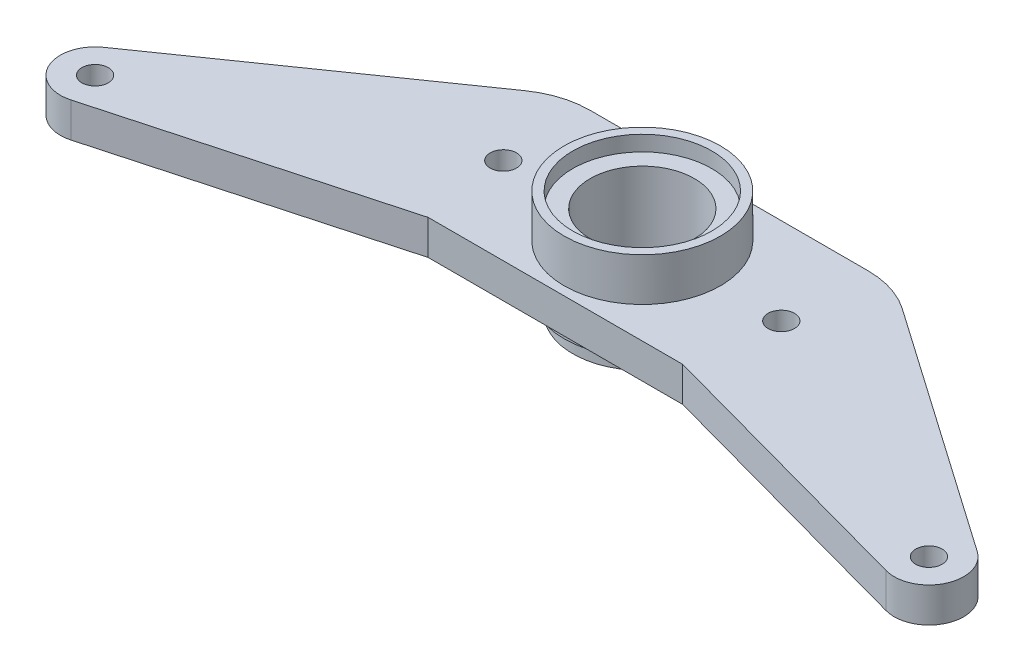
ISO-10303-21;
HEADER;
FILE_DESCRIPTION(('STEP AP214'),'2;1');
FILE_NAME('part.step','',(''),(''),'','','');
FILE_SCHEMA(('AUTOMOTIVE_DESIGN { 1 0 10303 214 1 1 1 1 }'));
ENDSEC;
DATA;
#1=APPLICATION_CONTEXT('core data for automotive mechanical design processes');
#2=APPLICATION_PROTOCOL_DEFINITION('international standard','automotive_design',2000,#1);
#3=PRODUCT_CONTEXT('',#1,'mechanical');
#4=PRODUCT('Part','Part','',(#3));
#5=PRODUCT_RELATED_PRODUCT_CATEGORY('part','',(#4));
#6=PRODUCT_DEFINITION_FORMATION('','',#4);
#7=PRODUCT_DEFINITION_CONTEXT('part definition',#1,'design');
#8=PRODUCT_DEFINITION('design','',#6,#7);
#9=PRODUCT_DEFINITION_SHAPE('','',#8);
#10=(LENGTH_UNIT() NAMED_UNIT(*) SI_UNIT(.MILLI.,.METRE.));
#11=(NAMED_UNIT(*) PLANE_ANGLE_UNIT() SI_UNIT($,.RADIAN.));
#12=(NAMED_UNIT(*) SI_UNIT($,.STERADIAN.) SOLID_ANGLE_UNIT());
#13=UNCERTAINTY_MEASURE_WITH_UNIT(LENGTH_MEASURE(1.E-05),#10,'distance_accuracy_value','');
#14=(GEOMETRIC_REPRESENTATION_CONTEXT(3) GLOBAL_UNCERTAINTY_ASSIGNED_CONTEXT((#13)) GLOBAL_UNIT_ASSIGNED_CONTEXT((#10,
#11,#12)) REPRESENTATION_CONTEXT('',''));
#15=CARTESIAN_POINT('',(0.,0.,0.));
#16=DIRECTION('',(0.,0.,1.));
#17=DIRECTION('',(1.,0.,0.));
#18=AXIS2_PLACEMENT_3D('',#15,#16,#17);
#19=CARTESIAN_POINT('',(0.,-5.207,0.));
#20=DIRECTION('',(0.,1.,0.));
#21=DIRECTION('',(0.,0.,1.));
#22=AXIS2_PLACEMENT_3D('',#19,#20,#21);
#23=CYLINDRICAL_SURFACE('',#22,14.2875);
#24=CARTESIAN_POINT('',(0.,0.,0.));
#25=DIRECTION('',(0.,1.,0.));
#26=DIRECTION('',(0.,0.,1.));
#27=AXIS2_PLACEMENT_3D('',#24,#25,#26);
#28=CIRCLE('',#27,14.2875);
#29=CARTESIAN_POINT('',(0.,0.,14.2875));
#30=VERTEX_POINT('',#29);
#31=EDGE_CURVE('E11',#30,#30,#28,.F.);
#32=ORIENTED_EDGE('',*,*,#31,.T.);
#33=EDGE_LOOP('',(#32));
#34=FACE_BOUND('',#33,.T.);
#35=CARTESIAN_POINT('',(0.,-2.032,0.));
#36=DIRECTION('',(0.,-1.,0.));
#37=DIRECTION('',(0.,0.,-1.));
#38=AXIS2_PLACEMENT_3D('',#35,#36,#37);
#39=CIRCLE('',#38,14.2875);
#40=CARTESIAN_POINT('',(0.,-2.032,-14.2875));
#41=VERTEX_POINT('',#40);
#42=EDGE_CURVE('E480',#41,#41,#39,.T.);
#43=ORIENTED_EDGE('',*,*,#42,.F.);
#44=EDGE_LOOP('',(#43));
#45=FACE_BOUND('',#44,.T.);
#46=ADVANCED_FACE('F37',(#34,#45),#23,.T.);
#47=CARTESIAN_POINT('',(17.3907664939202,6.35,-24.9388286839101));
#48=DIRECTION('',(0.571995390727013,0.,-0.820256833550962));
#49=DIRECTION('',(-0.820256833550962,0.,-0.571995390727013));
#50=AXIS2_PLACEMENT_3D('',#47,#48,#49);
#51=PLANE('',#50);
#52=DIRECTION('',(0.820256833550962,0.,0.571995390727013));
#53=VECTOR('',#52,1.);
#54=CARTESIAN_POINT('',(17.3907664939202,0.,-24.9388286839101));
#55=LINE('',#54,#53);
#56=CARTESIAN_POINT('',(34.4804268277913,0.,-13.0215772326215));
#57=VERTEX_POINT('',#56);
#58=CARTESIAN_POINT('',(79.8321707311165,0.,18.6038691069514));
#59=VERTEX_POINT('',#58);
#60=EDGE_CURVE('E147',#57,#59,#55,.T.);
#61=ORIENTED_EDGE('',*,*,#60,.F.);
#62=DIRECTION('',(0.,-1.,0.));
#63=VECTOR('',#62,1.);
#64=CARTESIAN_POINT('',(34.4804268277913,6.35,-13.0215772326215));
#65=LINE('',#64,#63);
#66=CARTESIAN_POINT('',(34.4804268277913,6.35,-13.0215772326215));
#67=VERTEX_POINT('',#66);
#68=EDGE_CURVE('E47',#67,#57,#65,.T.);
#69=ORIENTED_EDGE('',*,*,#68,.F.);
#70=DIRECTION('',(0.820256833550962,0.,0.571995390727013));
#71=VECTOR('',#70,1.);
#72=CARTESIAN_POINT('',(17.3907664939202,6.35,-24.9388286839101));
#73=LINE('',#72,#71);
#74=CARTESIAN_POINT('',(79.8321707311165,6.35,18.6038691069514));
#75=VERTEX_POINT('',#74);
#76=EDGE_CURVE('E170',#67,#75,#73,.T.);
#77=ORIENTED_EDGE('',*,*,#76,.T.);
#78=DIRECTION('',(0.,-1.,0.));
#79=VECTOR('',#78,1.);
#80=CARTESIAN_POINT('',(79.8321707311165,6.35,18.6038691069514));
#81=LINE('',#80,#79);
#82=EDGE_CURVE('E97',#75,#59,#81,.T.);
#83=ORIENTED_EDGE('',*,*,#82,.T.);
#84=EDGE_LOOP('',(#61,#69,#77,#83));
#85=FACE_BOUND('',#84,.T.);
#86=ADVANCED_FACE('F39',(#85),#51,.T.);
#87=CARTESIAN_POINT('',(25.4,6.35,0.));
#88=DIRECTION('',(0.,-1.,0.));
#89=DIRECTION('',(0.,0.,-1.));
#90=AXIS2_PLACEMENT_3D('',#87,#88,#89);
#91=CYLINDRICAL_SURFACE('',#90,15.875);
#92=CARTESIAN_POINT('',(25.4,0.,0.));
#93=DIRECTION('',(0.,1.,0.));
#94=DIRECTION('',(0.,0.,1.));
#95=AXIS2_PLACEMENT_3D('',#92,#93,#94);
#96=CIRCLE('',#95,15.875);
#97=CARTESIAN_POINT('',(25.4,0.,-15.875));
#98=VERTEX_POINT('',#97);
#99=EDGE_CURVE('E150',#57,#98,#96,.T.);
#100=ORIENTED_EDGE('',*,*,#99,.T.);
#101=DIRECTION('',(0.,-1.,0.));
#102=VECTOR('',#101,1.);
#103=CARTESIAN_POINT('',(25.4,6.35,-15.875));
#104=LINE('',#103,#102);
#105=CARTESIAN_POINT('',(25.4,6.35,-15.875));
#106=VERTEX_POINT('',#105);
#107=EDGE_CURVE('E184',#106,#98,#104,.T.);
#108=ORIENTED_EDGE('',*,*,#107,.F.);
#109=CARTESIAN_POINT('',(25.4,6.35,0.));
#110=DIRECTION('',(0.,1.,0.));
#111=DIRECTION('',(0.,0.,1.));
#112=AXIS2_PLACEMENT_3D('',#109,#110,#111);
#113=CIRCLE('',#112,15.875);
#114=EDGE_CURVE('E226',#67,#106,#113,.T.);
#115=ORIENTED_EDGE('',*,*,#114,.F.);
#116=ORIENTED_EDGE('',*,*,#68,.T.);
#117=EDGE_LOOP('',(#100,#108,#115,#116));
#118=FACE_BOUND('',#117,.T.);
#119=ADVANCED_FACE('F253',(#118),#91,.T.);
#120=CARTESIAN_POINT('',(0.,6.35,-15.875));
#121=DIRECTION('',(0.,0.,1.));
#122=DIRECTION('',(1.,0.,0.));
#123=AXIS2_PLACEMENT_3D('',#120,#121,#122);
#124=PLANE('',#123);
#125=DIRECTION('',(-1.,0.,0.));
#126=VECTOR('',#125,1.);
#127=CARTESIAN_POINT('',(0.,0.,-15.875));
#128=LINE('',#127,#126);
#129=CARTESIAN_POINT('',(-25.4,0.,-15.875));
#130=VERTEX_POINT('',#129);
#131=EDGE_CURVE('E153',#98,#130,#128,.T.);
#132=ORIENTED_EDGE('',*,*,#131,.T.);
#133=DIRECTION('',(0.,-1.,0.));
#134=VECTOR('',#133,1.);
#135=CARTESIAN_POINT('',(-25.4,6.35,-15.875));
#136=LINE('',#135,#134);
#137=CARTESIAN_POINT('',(-25.4,6.35,-15.875));
#138=VERTEX_POINT('',#137);
#139=EDGE_CURVE('E181',#138,#130,#136,.T.);
#140=ORIENTED_EDGE('',*,*,#139,.F.);
#141=DIRECTION('',(-1.,0.,0.));
#142=VECTOR('',#141,1.);
#143=CARTESIAN_POINT('',(0.,6.35,-15.875));
#144=LINE('',#143,#142);
#145=EDGE_CURVE('E228',#106,#138,#144,.T.);
#146=ORIENTED_EDGE('',*,*,#145,.F.);
#147=ORIENTED_EDGE('',*,*,#107,.T.);
#148=EDGE_LOOP('',(#132,#140,#146,#147));
#149=FACE_BOUND('',#148,.T.);
#150=ADVANCED_FACE('F256',(#149),#124,.F.);
#151=CARTESIAN_POINT('',(-25.4,6.35,0.));
#152=DIRECTION('',(0.,-1.,0.));
#153=DIRECTION('',(0.,0.,-1.));
#154=AXIS2_PLACEMENT_3D('',#151,#152,#153);
#155=CYLINDRICAL_SURFACE('',#154,15.875);
#156=CARTESIAN_POINT('',(-25.4,0.,0.));
#157=DIRECTION('',(0.,1.,0.));
#158=DIRECTION('',(0.,0.,1.));
#159=AXIS2_PLACEMENT_3D('',#156,#157,#158);
#160=CIRCLE('',#159,15.875);
#161=CARTESIAN_POINT('',(-34.4804268277913,0.,-13.0215772326215));
#162=VERTEX_POINT('',#161);
#163=EDGE_CURVE('E155',#130,#162,#160,.T.);
#164=ORIENTED_EDGE('',*,*,#163,.T.);
#165=DIRECTION('',(0.,-1.,0.));
#166=VECTOR('',#165,1.);
#167=CARTESIAN_POINT('',(-34.4804268277913,6.35,-13.0215772326215));
#168=LINE('',#167,#166);
#169=CARTESIAN_POINT('',(-34.4804268277913,6.35,-13.0215772326215));
#170=VERTEX_POINT('',#169);
#171=EDGE_CURVE('E179',#170,#162,#168,.T.);
#172=ORIENTED_EDGE('',*,*,#171,.F.);
#173=CARTESIAN_POINT('',(-25.4,6.35,0.));
#174=DIRECTION('',(0.,1.,0.));
#175=DIRECTION('',(0.,0.,1.));
#176=AXIS2_PLACEMENT_3D('',#173,#174,#175);
#177=CIRCLE('',#176,15.875);
#178=EDGE_CURVE('E230',#138,#170,#177,.T.);
#179=ORIENTED_EDGE('',*,*,#178,.F.);
#180=ORIENTED_EDGE('',*,*,#139,.T.);
#181=EDGE_LOOP('',(#164,#172,#179,#180));
#182=FACE_BOUND('',#181,.T.);
#183=ADVANCED_FACE('F261',(#182),#155,.T.);
#184=CARTESIAN_POINT('',(-17.3907664939203,6.35,-24.9388286839101));
#185=DIRECTION('',(-0.571995390727014,0.,-0.820256833550962));
#186=DIRECTION('',(-0.820256833550962,0.,0.571995390727014));
#187=AXIS2_PLACEMENT_3D('',#184,#185,#186);
#188=PLANE('',#187);
#189=DIRECTION('',(0.820256833550962,0.,-0.571995390727014));
#190=VECTOR('',#189,1.);
#191=CARTESIAN_POINT('',(-17.3907664939203,0.,-24.9388286839101));
#192=LINE('',#191,#190);
#193=CARTESIAN_POINT('',(-79.8321707311165,0.,18.6038691069514));
#194=VERTEX_POINT('',#193);
#195=EDGE_CURVE('E158',#194,#162,#192,.T.);
#196=ORIENTED_EDGE('',*,*,#195,.F.);
#197=DIRECTION('',(0.,-1.,0.));
#198=VECTOR('',#197,1.);
#199=CARTESIAN_POINT('',(-79.8321707311165,6.35,18.6038691069514));
#200=LINE('',#199,#198);
#201=CARTESIAN_POINT('',(-79.8321707311165,6.35,18.6038691069514));
#202=VERTEX_POINT('',#201);
#203=EDGE_CURVE('E177',#202,#194,#200,.T.);
#204=ORIENTED_EDGE('',*,*,#203,.F.);
#205=DIRECTION('',(0.820256833550962,0.,-0.571995390727014));
#206=VECTOR('',#205,1.);
#207=CARTESIAN_POINT('',(-17.3907664939203,6.35,-24.9388286839101));
#208=LINE('',#207,#206);
#209=EDGE_CURVE('E232',#202,#170,#208,.T.);
#210=ORIENTED_EDGE('',*,*,#209,.T.);
#211=ORIENTED_EDGE('',*,*,#171,.T.);
#212=EDGE_LOOP('',(#196,#204,#210,#211));
#213=FACE_BOUND('',#212,.T.);
#214=ADVANCED_FACE('F264',(#213),#188,.T.);
#215=CARTESIAN_POINT('',(-76.2,6.35,23.8125));
#216=DIRECTION('',(0.,-1.,0.));
#217=DIRECTION('',(0.,0.,-1.));
#218=AXIS2_PLACEMENT_3D('',#215,#216,#217);
#219=CYLINDRICAL_SURFACE('',#218,6.34999999999998);
#220=CARTESIAN_POINT('',(-76.2,0.,23.8125));
#221=DIRECTION('',(0.,1.,0.));
#222=DIRECTION('',(0.,0.,1.));
#223=AXIS2_PLACEMENT_3D('',#220,#221,#222);
#224=CIRCLE('',#223,6.34999999999998);
#225=CARTESIAN_POINT('',(-74.5201110943438,0.,29.9362629987331));
#226=VERTEX_POINT('',#225);
#227=EDGE_CURVE('E161',#194,#226,#224,.T.);
#228=ORIENTED_EDGE('',*,*,#227,.T.);
#229=DIRECTION('',(0.,-1.,0.));
#230=VECTOR('',#229,1.);
#231=CARTESIAN_POINT('',(-74.5201110943438,6.35,29.9362629987331));
#232=LINE('',#231,#230);
#233=CARTESIAN_POINT('',(-74.5201110943438,6.35,29.9362629987331));
#234=VERTEX_POINT('',#233);
#235=EDGE_CURVE('E174',#234,#226,#232,.T.);
#236=ORIENTED_EDGE('',*,*,#235,.F.);
#237=CARTESIAN_POINT('',(-76.2,6.35,23.8125));
#238=DIRECTION('',(0.,1.,0.));
#239=DIRECTION('',(0.,0.,1.));
#240=AXIS2_PLACEMENT_3D('',#237,#238,#239);
#241=CIRCLE('',#240,6.34999999999998);
#242=EDGE_CURVE('E142',#202,#234,#241,.T.);
#243=ORIENTED_EDGE('',*,*,#242,.F.);
#244=ORIENTED_EDGE('',*,*,#203,.T.);
#245=EDGE_LOOP('',(#228,#236,#243,#244));
#246=FACE_BOUND('',#245,.T.);
#247=ADVANCED_FACE('F238',(#246),#219,.T.);
#248=CARTESIAN_POINT('',(2.42206762770156,6.35,8.82925535671346));
#249=DIRECTION('',(-0.264549433961601,0.,-0.964372125784749));
#250=DIRECTION('',(-0.964372125784749,0.,0.264549433961601));
#251=AXIS2_PLACEMENT_3D('',#248,#249,#250);
#252=PLANE('',#251);
#253=DIRECTION('',(0.964372125784749,0.,-0.264549433961601));
#254=VECTOR('',#253,1.);
#255=CARTESIAN_POINT('',(2.42206762770156,0.,8.82925535671346));
#256=LINE('',#255,#254);
#257=CARTESIAN_POINT('',(-23.2620536256783,0.,15.875));
#258=VERTEX_POINT('',#257);
#259=EDGE_CURVE('E163',#226,#258,#256,.T.);
#260=ORIENTED_EDGE('',*,*,#259,.T.);
#261=DIRECTION('',(0.,-1.,0.));
#262=VECTOR('',#261,1.);
#263=CARTESIAN_POINT('',(-23.2620536256783,6.35,15.875));
#264=LINE('',#263,#262);
#265=CARTESIAN_POINT('',(-23.2620536256783,6.35,15.875));
#266=VERTEX_POINT('',#265);
#267=EDGE_CURVE('E131',#266,#258,#264,.T.);
#268=ORIENTED_EDGE('',*,*,#267,.F.);
#269=DIRECTION('',(0.964372125784749,0.,-0.264549433961601));
#270=VECTOR('',#269,1.);
#271=CARTESIAN_POINT('',(2.42206762770156,6.35,8.82925535671346));
#272=LINE('',#271,#270);
#273=EDGE_CURVE('E139',#234,#266,#272,.T.);
#274=ORIENTED_EDGE('',*,*,#273,.F.);
#275=ORIENTED_EDGE('',*,*,#235,.T.);
#276=EDGE_LOOP('',(#260,#268,#274,#275));
#277=FACE_BOUND('',#276,.T.);
#278=ADVANCED_FACE('F242',(#277),#252,.F.);
#279=CARTESIAN_POINT('',(0.,6.35,15.875));
#280=DIRECTION('',(0.,0.,1.));
#281=DIRECTION('',(1.,0.,0.));
#282=AXIS2_PLACEMENT_3D('',#279,#280,#281);
#283=PLANE('',#282);
#284=DIRECTION('',(-1.,0.,0.));
#285=VECTOR('',#284,1.);
#286=CARTESIAN_POINT('',(0.,0.,15.875));
#287=LINE('',#286,#285);
#288=CARTESIAN_POINT('',(23.2620536256783,0.,15.875));
#289=VERTEX_POINT('',#288);
#290=EDGE_CURVE('E130',#289,#258,#287,.T.);
#291=ORIENTED_EDGE('',*,*,#290,.F.);
#292=DIRECTION('',(0.,-1.,0.));
#293=VECTOR('',#292,1.);
#294=CARTESIAN_POINT('',(23.2620536256783,6.35,15.875));
#295=LINE('',#294,#293);
#296=CARTESIAN_POINT('',(23.2620536256783,6.35,15.875));
#297=VERTEX_POINT('',#296);
#298=EDGE_CURVE('E124',#297,#289,#295,.T.);
#299=ORIENTED_EDGE('',*,*,#298,.F.);
#300=DIRECTION('',(-1.,0.,0.));
#301=VECTOR('',#300,1.);
#302=CARTESIAN_POINT('',(0.,6.35,15.875));
#303=LINE('',#302,#301);
#304=EDGE_CURVE('E128',#297,#266,#303,.T.);
#305=ORIENTED_EDGE('',*,*,#304,.T.);
#306=ORIENTED_EDGE('',*,*,#267,.T.);
#307=EDGE_LOOP('',(#291,#299,#305,#306));
#308=FACE_BOUND('',#307,.T.);
#309=ADVANCED_FACE('F126',(#308),#283,.T.);
#310=CARTESIAN_POINT('',(-2.42206762770156,6.35,8.82925535671346));
#311=DIRECTION('',(0.264549433961601,0.,-0.96437212578475));
#312=DIRECTION('',(-0.96437212578475,0.,-0.264549433961601));
#313=AXIS2_PLACEMENT_3D('',#310,#311,#312);
#314=PLANE('',#313);
#315=DIRECTION('',(0.96437212578475,0.,0.264549433961601));
#316=VECTOR('',#315,1.);
#317=CARTESIAN_POINT('',(-2.42206762770156,0.,8.82925535671346));
#318=LINE('',#317,#316);
#319=CARTESIAN_POINT('',(74.5201110943438,0.,29.9362629987331));
#320=VERTEX_POINT('',#319);
#321=EDGE_CURVE('E90',#289,#320,#318,.T.);
#322=ORIENTED_EDGE('',*,*,#321,.T.);
#323=DIRECTION('',(0.,-1.,0.));
#324=VECTOR('',#323,1.);
#325=CARTESIAN_POINT('',(74.5201110943438,6.35,29.9362629987331));
#326=LINE('',#325,#324);
#327=CARTESIAN_POINT('',(74.5201110943438,6.35,29.9362629987331));
#328=VERTEX_POINT('',#327);
#329=EDGE_CURVE('E132',#328,#320,#326,.T.);
#330=ORIENTED_EDGE('',*,*,#329,.F.);
#331=DIRECTION('',(0.96437212578475,0.,0.264549433961601));
#332=VECTOR('',#331,1.);
#333=CARTESIAN_POINT('',(-2.42206762770156,6.35,8.82925535671346));
#334=LINE('',#333,#332);
#335=EDGE_CURVE('E134',#297,#328,#334,.T.);
#336=ORIENTED_EDGE('',*,*,#335,.F.);
#337=ORIENTED_EDGE('',*,*,#298,.T.);
#338=EDGE_LOOP('',(#322,#330,#336,#337));
#339=FACE_BOUND('',#338,.T.);
#340=ADVANCED_FACE('F135',(#339),#314,.F.);
#341=CARTESIAN_POINT('',(76.2,6.35,23.8125));
#342=DIRECTION('',(0.,-1.,0.));
#343=DIRECTION('',(0.,0.,-1.));
#344=AXIS2_PLACEMENT_3D('',#341,#342,#343);
#345=CYLINDRICAL_SURFACE('',#344,6.34999999999998);
#346=CARTESIAN_POINT('',(76.2,0.,23.8125));
#347=DIRECTION('',(0.,1.,0.));
#348=DIRECTION('',(0.,0.,1.));
#349=AXIS2_PLACEMENT_3D('',#346,#347,#348);
#350=CIRCLE('',#349,6.34999999999998);
#351=EDGE_CURVE('E168',#320,#59,#350,.T.);
#352=ORIENTED_EDGE('',*,*,#351,.T.);
#353=ORIENTED_EDGE('',*,*,#82,.F.);
#354=CARTESIAN_POINT('',(76.2,6.35,23.8125));
#355=DIRECTION('',(0.,1.,0.));
#356=DIRECTION('',(0.,0.,1.));
#357=AXIS2_PLACEMENT_3D('',#354,#355,#356);
#358=CIRCLE('',#357,6.34999999999998);
#359=EDGE_CURVE('E56',#328,#75,#358,.T.);
#360=ORIENTED_EDGE('',*,*,#359,.F.);
#361=ORIENTED_EDGE('',*,*,#329,.T.);
#362=EDGE_LOOP('',(#352,#353,#360,#361));
#363=FACE_BOUND('',#362,.T.);
#364=ADVANCED_FACE('F248',(#363),#345,.T.);
#365=CARTESIAN_POINT('',(0.,6.35,0.));
#366=DIRECTION('',(0.,1.,0.));
#367=DIRECTION('',(0.,0.,1.));
#368=AXIS2_PLACEMENT_3D('',#365,#366,#367);
#369=PLANE('',#368);
#370=CARTESIAN_POINT('',(-25.4,6.35,0.));
#371=DIRECTION('',(0.,1.,0.));
#372=DIRECTION('',(0.,0.,1.));
#373=AXIS2_PLACEMENT_3D('',#370,#371,#372);
#374=CIRCLE('',#373,2.41299999999999);
#375=CARTESIAN_POINT('',(-25.4,6.35,2.41299999999999));
#376=VERTEX_POINT('',#375);
#377=EDGE_CURVE('E485',#376,#376,#374,.T.);
#378=ORIENTED_EDGE('',*,*,#377,.F.);
#379=EDGE_LOOP('',(#378));
#380=FACE_BOUND('',#379,.T.);
#381=CARTESIAN_POINT('',(25.4,6.35,0.));
#382=DIRECTION('',(0.,1.,0.));
#383=DIRECTION('',(0.,0.,1.));
#384=AXIS2_PLACEMENT_3D('',#381,#382,#383);
#385=CIRCLE('',#384,2.41299999999999);
#386=CARTESIAN_POINT('',(25.4,6.35,2.41299999999999));
#387=VERTEX_POINT('',#386);
#388=EDGE_CURVE('E205',#387,#387,#385,.T.);
#389=ORIENTED_EDGE('',*,*,#388,.F.);
#390=EDGE_LOOP('',(#389));
#391=FACE_BOUND('',#390,.T.);
#392=CARTESIAN_POINT('',(-76.2,6.35,23.8125));
#393=DIRECTION('',(0.,1.,0.));
#394=DIRECTION('',(0.,0.,1.));
#395=AXIS2_PLACEMENT_3D('',#392,#393,#394);
#396=CIRCLE('',#395,2.41299999999998);
#397=CARTESIAN_POINT('',(-76.2,6.35,26.2255));
#398=VERTEX_POINT('',#397);
#399=EDGE_CURVE('E194',#398,#398,#396,.T.);
#400=ORIENTED_EDGE('',*,*,#399,.F.);
#401=EDGE_LOOP('',(#400));
#402=FACE_BOUND('',#401,.T.);
#403=CARTESIAN_POINT('',(76.2,6.35,23.8125));
#404=DIRECTION('',(0.,1.,0.));
#405=DIRECTION('',(0.,0.,1.));
#406=AXIS2_PLACEMENT_3D('',#403,#404,#405);
#407=CIRCLE('',#406,2.41299999999998);
#408=CARTESIAN_POINT('',(76.2,6.35,26.2255));
#409=VERTEX_POINT('',#408);
#410=EDGE_CURVE('E191',#409,#409,#407,.T.);
#411=ORIENTED_EDGE('',*,*,#410,.F.);
#412=EDGE_LOOP('',(#411));
#413=FACE_BOUND('',#412,.T.);
#414=CARTESIAN_POINT('',(0.,6.35,0.));
#415=DIRECTION('',(0.,1.,0.));
#416=DIRECTION('',(0.,0.,1.));
#417=AXIS2_PLACEMENT_3D('',#414,#415,#416);
#418=CIRCLE('',#417,14.2875);
#419=CARTESIAN_POINT('',(0.,6.35,14.2875));
#420=VERTEX_POINT('',#419);
#421=EDGE_CURVE('E151',#420,#420,#418,.F.);
#422=ORIENTED_EDGE('',*,*,#421,.T.);
#423=EDGE_LOOP('',(#422));
#424=FACE_BOUND('',#423,.T.);
#425=ORIENTED_EDGE('',*,*,#76,.F.);
#426=ORIENTED_EDGE('',*,*,#114,.T.);
#427=ORIENTED_EDGE('',*,*,#145,.T.);
#428=ORIENTED_EDGE('',*,*,#178,.T.);
#429=ORIENTED_EDGE('',*,*,#209,.F.);
#430=ORIENTED_EDGE('',*,*,#242,.T.);
#431=ORIENTED_EDGE('',*,*,#273,.T.);
#432=ORIENTED_EDGE('',*,*,#304,.F.);
#433=ORIENTED_EDGE('',*,*,#335,.T.);
#434=ORIENTED_EDGE('',*,*,#359,.T.);
#435=EDGE_LOOP('',(#425,#426,#427,#428,#429,#430,#431,#432,#433,#434));
#436=FACE_BOUND('',#435,.T.);
#437=ADVANCED_FACE('F137',(#380,#391,#402,#413,#424,#436),#369,.T.);
#438=CARTESIAN_POINT('',(0.,0.,0.));
#439=DIRECTION('',(0.,1.,0.));
#440=DIRECTION('',(0.,0.,1.));
#441=AXIS2_PLACEMENT_3D('',#438,#439,#440);
#442=PLANE('',#441);
#443=CARTESIAN_POINT('',(-25.4,0.,0.));
#444=DIRECTION('',(0.,1.,0.));
#445=DIRECTION('',(0.,0.,1.));
#446=AXIS2_PLACEMENT_3D('',#443,#444,#445);
#447=CIRCLE('',#446,2.41299999999999);
#448=CARTESIAN_POINT('',(-25.4,0.,2.41299999999999));
#449=VERTEX_POINT('',#448);
#450=EDGE_CURVE('E41',#449,#449,#447,.T.);
#451=ORIENTED_EDGE('',*,*,#450,.T.);
#452=EDGE_LOOP('',(#451));
#453=FACE_BOUND('',#452,.T.);
#454=CARTESIAN_POINT('',(25.4,0.,0.));
#455=DIRECTION('',(0.,1.,0.));
#456=DIRECTION('',(0.,0.,1.));
#457=AXIS2_PLACEMENT_3D('',#454,#455,#456);
#458=CIRCLE('',#457,2.41299999999999);
#459=CARTESIAN_POINT('',(25.4,0.,2.41299999999999));
#460=VERTEX_POINT('',#459);
#461=EDGE_CURVE('E200',#460,#460,#458,.T.);
#462=ORIENTED_EDGE('',*,*,#461,.T.);
#463=EDGE_LOOP('',(#462));
#464=FACE_BOUND('',#463,.T.);
#465=CARTESIAN_POINT('',(-76.2,0.,23.8125));
#466=DIRECTION('',(0.,1.,0.));
#467=DIRECTION('',(0.,0.,1.));
#468=AXIS2_PLACEMENT_3D('',#465,#466,#467);
#469=CIRCLE('',#468,2.41299999999999);
#470=CARTESIAN_POINT('',(-76.2,0.,26.2255));
#471=VERTEX_POINT('',#470);
#472=EDGE_CURVE('E192',#471,#471,#469,.T.);
#473=ORIENTED_EDGE('',*,*,#472,.T.);
#474=EDGE_LOOP('',(#473));
#475=FACE_BOUND('',#474,.T.);
#476=CARTESIAN_POINT('',(76.2,0.,23.8125));
#477=DIRECTION('',(0.,1.,0.));
#478=DIRECTION('',(0.,0.,1.));
#479=AXIS2_PLACEMENT_3D('',#476,#477,#478);
#480=CIRCLE('',#479,2.41299999999999);
#481=CARTESIAN_POINT('',(76.2,0.,26.2255));
#482=VERTEX_POINT('',#481);
#483=EDGE_CURVE('E188',#482,#482,#480,.T.);
#484=ORIENTED_EDGE('',*,*,#483,.T.);
#485=EDGE_LOOP('',(#484));
#486=FACE_BOUND('',#485,.T.);
#487=ORIENTED_EDGE('',*,*,#31,.F.);
#488=EDGE_LOOP('',(#487));
#489=FACE_BOUND('',#488,.T.);
#490=ORIENTED_EDGE('',*,*,#60,.T.);
#491=ORIENTED_EDGE('',*,*,#351,.F.);
#492=ORIENTED_EDGE('',*,*,#321,.F.);
#493=ORIENTED_EDGE('',*,*,#290,.T.);
#494=ORIENTED_EDGE('',*,*,#259,.F.);
#495=ORIENTED_EDGE('',*,*,#227,.F.);
#496=ORIENTED_EDGE('',*,*,#195,.T.);
#497=ORIENTED_EDGE('',*,*,#163,.F.);
#498=ORIENTED_EDGE('',*,*,#131,.F.);
#499=ORIENTED_EDGE('',*,*,#99,.F.);
#500=EDGE_LOOP('',(#490,#491,#492,#493,#494,#495,#496,#497,#498,#499));
#501=FACE_BOUND('',#500,.T.);
#502=ADVANCED_FACE('F244',(#453,#464,#475,#486,#489,#501),#442,.F.);
#503=ORIENTED_EDGE('',*,*,#421,.F.);
#504=EDGE_LOOP('',(#503));
#505=FACE_BOUND('',#504,.T.);
#506=CARTESIAN_POINT('',(0.,14.224,0.));
#507=DIRECTION('',(0.,-1.,0.));
#508=DIRECTION('',(0.,0.,-1.));
#509=AXIS2_PLACEMENT_3D('',#506,#507,#508);
#510=CIRCLE('',#509,14.2875);
#511=CARTESIAN_POINT('',(0.,14.224,-14.2875));
#512=VERTEX_POINT('',#511);
#513=EDGE_CURVE('E220',#512,#512,#510,.T.);
#514=ORIENTED_EDGE('',*,*,#513,.T.);
#515=EDGE_LOOP('',(#514));
#516=FACE_BOUND('',#515,.T.);
#517=ADVANCED_FACE('F276',(#505,#516),#23,.T.);
#518=CARTESIAN_POINT('',(0.,14.224,0.));
#519=DIRECTION('',(0.,-1.,0.));
#520=DIRECTION('',(0.,0.,-1.));
#521=AXIS2_PLACEMENT_3D('',#518,#519,#520);
#522=PLANE('',#521);
#523=CARTESIAN_POINT('',(0.,14.224,0.));
#524=DIRECTION('',(0.,1.,0.));
#525=DIRECTION('',(0.,0.,1.));
#526=AXIS2_PLACEMENT_3D('',#523,#524,#525);
#527=CIRCLE('',#526,12.7);
#528=CARTESIAN_POINT('',(0.,14.224,12.7));
#529=VERTEX_POINT('',#528);
#530=EDGE_CURVE('E190',#529,#529,#527,.T.);
#531=ORIENTED_EDGE('',*,*,#530,.F.);
#532=EDGE_LOOP('',(#531));
#533=FACE_BOUND('',#532,.T.);
#534=ORIENTED_EDGE('',*,*,#513,.F.);
#535=EDGE_LOOP('',(#534));
#536=FACE_BOUND('',#535,.T.);
#537=ADVANCED_FACE('F284',(#533,#536),#522,.F.);
#538=CARTESIAN_POINT('',(0.,-4.826,0.));
#539=DIRECTION('',(0.,-1.,0.));
#540=DIRECTION('',(0.,0.,-1.));
#541=AXIS2_PLACEMENT_3D('',#538,#539,#540);
#542=PLANE('',#541);
#543=CARTESIAN_POINT('',(0.,-4.826,0.));
#544=DIRECTION('',(0.,1.,0.));
#545=DIRECTION('',(0.,0.,1.));
#546=AXIS2_PLACEMENT_3D('',#543,#544,#545);
#547=CIRCLE('',#546,9.52500000000001);
#548=CARTESIAN_POINT('',(0.,-4.826,9.52500000000001));
#549=VERTEX_POINT('',#548);
#550=EDGE_CURVE('E217',#549,#549,#547,.T.);
#551=ORIENTED_EDGE('',*,*,#550,.T.);
#552=EDGE_LOOP('',(#551));
#553=FACE_BOUND('',#552,.T.);
#554=ADVANCED_FACE('F290',(#553),#542,.F.);
#555=CARTESIAN_POINT('',(0.,14.224,0.));
#556=DIRECTION('',(0.,1.,0.));
#557=DIRECTION('',(0.,0.,1.));
#558=AXIS2_PLACEMENT_3D('',#555,#556,#557);
#559=CYLINDRICAL_SURFACE('',#558,9.52500000000001);
#560=ORIENTED_EDGE('',*,*,#550,.F.);
#561=EDGE_LOOP('',(#560));
#562=FACE_BOUND('',#561,.T.);
#563=CARTESIAN_POINT('',(0.,11.43,0.));
#564=DIRECTION('',(0.,1.,0.));
#565=DIRECTION('',(0.,0.,1.));
#566=AXIS2_PLACEMENT_3D('',#563,#564,#565);
#567=CIRCLE('',#566,9.52500000000001);
#568=CARTESIAN_POINT('',(0.,11.43,9.52500000000001));
#569=VERTEX_POINT('',#568);
#570=EDGE_CURVE('E214',#569,#569,#567,.T.);
#571=ORIENTED_EDGE('',*,*,#570,.T.);
#572=EDGE_LOOP('',(#571));
#573=FACE_BOUND('',#572,.T.);
#574=ADVANCED_FACE('F350',(#562,#573),#559,.F.);
#575=CARTESIAN_POINT('',(9.52500000000001,11.43,0.));
#576=DIRECTION('',(0.,-1.,0.));
#577=DIRECTION('',(0.,0.,-1.));
#578=AXIS2_PLACEMENT_3D('',#575,#576,#577);
#579=PLANE('',#578);
#580=ORIENTED_EDGE('',*,*,#570,.F.);
#581=EDGE_LOOP('',(#580));
#582=FACE_BOUND('',#581,.T.);
#583=CARTESIAN_POINT('',(0.,11.43,0.));
#584=DIRECTION('',(0.,1.,0.));
#585=DIRECTION('',(0.,0.,1.));
#586=AXIS2_PLACEMENT_3D('',#583,#584,#585);
#587=CIRCLE('',#586,12.7);
#588=CARTESIAN_POINT('',(0.,11.43,12.7));
#589=VERTEX_POINT('',#588);
#590=EDGE_CURVE('E211',#589,#589,#587,.T.);
#591=ORIENTED_EDGE('',*,*,#590,.T.);
#592=EDGE_LOOP('',(#591));
#593=FACE_BOUND('',#592,.T.);
#594=ADVANCED_FACE('F360',(#582,#593),#579,.F.);
#595=CARTESIAN_POINT('',(0.,14.224,0.));
#596=DIRECTION('',(0.,1.,0.));
#597=DIRECTION('',(0.,0.,1.));
#598=AXIS2_PLACEMENT_3D('',#595,#596,#597);
#599=CYLINDRICAL_SURFACE('',#598,12.7);
#600=ORIENTED_EDGE('',*,*,#590,.F.);
#601=EDGE_LOOP('',(#600));
#602=FACE_BOUND('',#601,.T.);
#603=ORIENTED_EDGE('',*,*,#530,.T.);
#604=EDGE_LOOP('',(#603));
#605=FACE_BOUND('',#604,.T.);
#606=ADVANCED_FACE('F370',(#602,#605),#599,.F.);
#607=CARTESIAN_POINT('',(76.2,6.35,23.8125));
#608=DIRECTION('',(0.,1.,0.));
#609=DIRECTION('',(0.,0.,1.));
#610=AXIS2_PLACEMENT_3D('',#607,#608,#609);
#611=CYLINDRICAL_SURFACE('',#610,2.41299999999999);
#612=ORIENTED_EDGE('',*,*,#410,.T.);
#613=EDGE_LOOP('',(#612));
#614=FACE_BOUND('',#613,.T.);
#615=ORIENTED_EDGE('',*,*,#483,.F.);
#616=EDGE_LOOP('',(#615));
#617=FACE_BOUND('',#616,.T.);
#618=ADVANCED_FACE('F379',(#614,#617),#611,.F.);
#619=CARTESIAN_POINT('',(-76.2,6.35,23.8125));
#620=DIRECTION('',(0.,1.,0.));
#621=DIRECTION('',(0.,0.,1.));
#622=AXIS2_PLACEMENT_3D('',#619,#620,#621);
#623=CYLINDRICAL_SURFACE('',#622,2.41299999999999);
#624=ORIENTED_EDGE('',*,*,#399,.T.);
#625=EDGE_LOOP('',(#624));
#626=FACE_BOUND('',#625,.T.);
#627=ORIENTED_EDGE('',*,*,#472,.F.);
#628=EDGE_LOOP('',(#627));
#629=FACE_BOUND('',#628,.T.);
#630=ADVANCED_FACE('F403',(#626,#629),#623,.F.);
#631=CARTESIAN_POINT('',(25.4,6.35,0.));
#632=DIRECTION('',(0.,1.,0.));
#633=DIRECTION('',(0.,0.,1.));
#634=AXIS2_PLACEMENT_3D('',#631,#632,#633);
#635=CYLINDRICAL_SURFACE('',#634,2.41299999999999);
#636=ORIENTED_EDGE('',*,*,#388,.T.);
#637=EDGE_LOOP('',(#636));
#638=FACE_BOUND('',#637,.T.);
#639=ORIENTED_EDGE('',*,*,#461,.F.);
#640=EDGE_LOOP('',(#639));
#641=FACE_BOUND('',#640,.T.);
#642=ADVANCED_FACE('F415',(#638,#641),#635,.F.);
#643=CARTESIAN_POINT('',(-25.4,6.35,0.));
#644=DIRECTION('',(0.,1.,0.));
#645=DIRECTION('',(0.,0.,1.));
#646=AXIS2_PLACEMENT_3D('',#643,#644,#645);
#647=CYLINDRICAL_SURFACE('',#646,2.41299999999999);
#648=ORIENTED_EDGE('',*,*,#377,.T.);
#649=EDGE_LOOP('',(#648));
#650=FACE_BOUND('',#649,.T.);
#651=ORIENTED_EDGE('',*,*,#450,.F.);
#652=EDGE_LOOP('',(#651));
#653=FACE_BOUND('',#652,.T.);
#654=ADVANCED_FACE('F425',(#650,#653),#647,.F.);
#655=CARTESIAN_POINT('',(0.,-2.032,0.));
#656=DIRECTION('',(0.,-1.,0.));
#657=DIRECTION('',(0.,0.,-1.));
#658=AXIS2_PLACEMENT_3D('',#655,#656,#657);
#659=PLANE('',#658);
#660=CARTESIAN_POINT('',(0.,-2.032,0.));
#661=DIRECTION('',(0.,-1.,0.));
#662=DIRECTION('',(0.,0.,-1.));
#663=AXIS2_PLACEMENT_3D('',#660,#661,#662);
#664=CIRCLE('',#663,12.7);
#665=CARTESIAN_POINT('',(0.,-2.032,-12.7));
#666=VERTEX_POINT('',#665);
#667=EDGE_CURVE('E477',#666,#666,#664,.T.);
#668=ORIENTED_EDGE('',*,*,#667,.F.);
#669=EDGE_LOOP('',(#668));
#670=FACE_BOUND('',#669,.T.);
#671=ORIENTED_EDGE('',*,*,#42,.T.);
#672=EDGE_LOOP('',(#671));
#673=FACE_BOUND('',#672,.T.);
#674=ADVANCED_FACE('F434',(#670,#673),#659,.T.);
#675=CARTESIAN_POINT('',(0.,-2.032,0.));
#676=DIRECTION('',(0.,-1.,0.));
#677=DIRECTION('',(0.,0.,-1.));
#678=AXIS2_PLACEMENT_3D('',#675,#676,#677);
#679=CYLINDRICAL_SURFACE('',#678,12.7);
#680=ORIENTED_EDGE('',*,*,#667,.T.);
#681=EDGE_LOOP('',(#680));
#682=FACE_BOUND('',#681,.T.);
#683=CARTESIAN_POINT('',(0.,-5.207,0.));
#684=DIRECTION('',(0.,-1.,0.));
#685=DIRECTION('',(0.,0.,-1.));
#686=AXIS2_PLACEMENT_3D('',#683,#684,#685);
#687=CIRCLE('',#686,12.7);
#688=CARTESIAN_POINT('',(0.,-5.207,-12.7));
#689=VERTEX_POINT('',#688);
#690=EDGE_CURVE('E475',#689,#689,#687,.T.);
#691=ORIENTED_EDGE('',*,*,#690,.F.);
#692=EDGE_LOOP('',(#691));
#693=FACE_BOUND('',#692,.T.);
#694=ADVANCED_FACE('F450',(#682,#693),#679,.T.);
#695=CARTESIAN_POINT('',(0.,-5.207,0.));
#696=DIRECTION('',(0.,-1.,0.));
#697=DIRECTION('',(0.,0.,-1.));
#698=AXIS2_PLACEMENT_3D('',#695,#696,#697);
#699=PLANE('',#698);
#700=ORIENTED_EDGE('',*,*,#690,.T.);
#701=EDGE_LOOP('',(#700));
#702=FACE_BOUND('',#701,.T.);
#703=ADVANCED_FACE('F460',(#702),#699,.T.);
#704=CLOSED_SHELL('',(#46,#86,#119,#150,#183,#214,#247,#278,#309,#340,#364,#437,#502,#517,#537,
#554,#574,#594,#606,#618,#630,#642,#654,#674,#694,#703));
#705=MANIFOLD_SOLID_BREP('B2',#704);
#706=ADVANCED_BREP_SHAPE_REPRESENTATION('',(#18,#705),#14);
#707=SHAPE_DEFINITION_REPRESENTATION(#9,#706);
ENDSEC;
END-ISO-10303-21;
